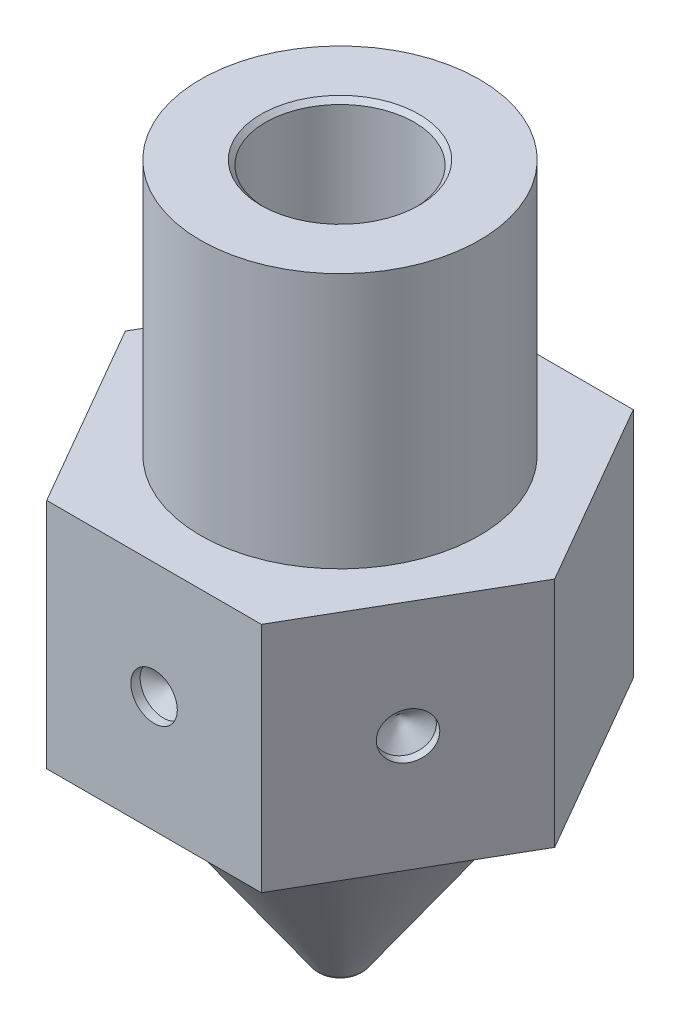
ISO-10303-21;
HEADER;
FILE_DESCRIPTION(('STEP AP214'),'2;1');
FILE_NAME('part.step','',(''),(''),'','','');
FILE_SCHEMA(('AUTOMOTIVE_DESIGN { 1 0 10303 214 1 1 1 1 }'));
ENDSEC;
DATA;
#1=APPLICATION_CONTEXT('core data for automotive mechanical design processes');
#2=APPLICATION_PROTOCOL_DEFINITION('international standard','automotive_design',2000,#1);
#3=PRODUCT_CONTEXT('',#1,'mechanical');
#4=PRODUCT('Part','Part','',(#3));
#5=PRODUCT_RELATED_PRODUCT_CATEGORY('part','',(#4));
#6=PRODUCT_DEFINITION_FORMATION('','',#4);
#7=PRODUCT_DEFINITION_CONTEXT('part definition',#1,'design');
#8=PRODUCT_DEFINITION('design','',#6,#7);
#9=PRODUCT_DEFINITION_SHAPE('','',#8);
#10=(LENGTH_UNIT() NAMED_UNIT(*) SI_UNIT(.MILLI.,.METRE.));
#11=(NAMED_UNIT(*) PLANE_ANGLE_UNIT() SI_UNIT($,.RADIAN.));
#12=(NAMED_UNIT(*) SI_UNIT($,.STERADIAN.) SOLID_ANGLE_UNIT());
#13=UNCERTAINTY_MEASURE_WITH_UNIT(LENGTH_MEASURE(1.E-05),#10,'distance_accuracy_value','');
#14=(GEOMETRIC_REPRESENTATION_CONTEXT(3) GLOBAL_UNCERTAINTY_ASSIGNED_CONTEXT((#13)) GLOBAL_UNIT_ASSIGNED_CONTEXT((#10,
#11,#12)) REPRESENTATION_CONTEXT('',''));
#15=CARTESIAN_POINT('',(0.,0.,0.));
#16=DIRECTION('',(0.,0.,1.));
#17=DIRECTION('',(1.,0.,0.));
#18=AXIS2_PLACEMENT_3D('',#15,#16,#17);
#19=CARTESIAN_POINT('',(3.55710403710923,4.5,0.));
#20=DIRECTION('',(0.,-1.,0.));
#21=DIRECTION('',(0.,0.,-1.));
#22=AXIS2_PLACEMENT_3D('',#19,#20,#21);
#23=PLANE('',#22);
#24=CARTESIAN_POINT('',(0.,4.5,0.));
#25=DIRECTION('',(0.,-1.,0.));
#26=DIRECTION('',(0.,0.,-1.));
#27=AXIS2_PLACEMENT_3D('',#24,#25,#26);
#28=CIRCLE('',#27,3.55710403710923);
#29=CARTESIAN_POINT('',(0.,4.5,-3.55710403710923));
#30=VERTEX_POINT('',#29);
#31=EDGE_CURVE('E156',#30,#30,#28,.T.);
#32=ORIENTED_EDGE('',*,*,#31,.F.);
#33=EDGE_LOOP('',(#32));
#34=FACE_BOUND('',#33,.T.);
#35=DIRECTION('',(1.,0.,0.));
#36=VECTOR('',#35,1.);
#37=CARTESIAN_POINT('',(3.55710403710923,4.5,-4.));
#38=LINE('',#37,#36);
#39=CARTESIAN_POINT('',(-2.3094010767585,4.5,-4.));
#40=VERTEX_POINT('',#39);
#41=CARTESIAN_POINT('',(2.3094010767585,4.5,-4.));
#42=VERTEX_POINT('',#41);
#43=EDGE_CURVE('E115',#40,#42,#38,.T.);
#44=ORIENTED_EDGE('',*,*,#43,.T.);
#45=DIRECTION('',(0.5,0.,0.866025403784438));
#46=VECTOR('',#45,1.);
#47=CARTESIAN_POINT('',(4.35337762441506,4.5,-0.459728769979613));
#48=LINE('',#47,#46);
#49=CARTESIAN_POINT('',(4.61880215351701,4.5,0.));
#50=VERTEX_POINT('',#49);
#51=EDGE_CURVE('E141',#42,#50,#48,.T.);
#52=ORIENTED_EDGE('',*,*,#51,.T.);
#53=DIRECTION('',(-0.5,0.,0.866025403784439));
#54=VECTOR('',#53,1.);
#55=CARTESIAN_POINT('',(4.35337762441506,4.5,0.459728769979613));
#56=LINE('',#55,#54);
#57=CARTESIAN_POINT('',(2.30940107675851,4.5,4.));
#58=VERTEX_POINT('',#57);
#59=EDGE_CURVE('E138',#50,#58,#56,.T.);
#60=ORIENTED_EDGE('',*,*,#59,.T.);
#61=DIRECTION('',(-1.,0.,0.));
#62=VECTOR('',#61,1.);
#63=CARTESIAN_POINT('',(3.55710403710923,4.5,4.));
#64=LINE('',#63,#62);
#65=CARTESIAN_POINT('',(-2.3094010767585,4.5,4.));
#66=VERTEX_POINT('',#65);
#67=EDGE_CURVE('E135',#58,#66,#64,.T.);
#68=ORIENTED_EDGE('',*,*,#67,.T.);
#69=DIRECTION('',(-0.500000000000001,0.,-0.866025403784438));
#70=VECTOR('',#69,1.);
#71=CARTESIAN_POINT('',(-2.57482560586044,4.5,3.54027123002039));
#72=LINE('',#71,#70);
#73=CARTESIAN_POINT('',(-4.61880215351701,4.5,0.));
#74=VERTEX_POINT('',#73);
#75=EDGE_CURVE('E132',#66,#74,#72,.T.);
#76=ORIENTED_EDGE('',*,*,#75,.T.);
#77=DIRECTION('',(0.5,0.,-0.866025403784439));
#78=VECTOR('',#77,1.);
#79=CARTESIAN_POINT('',(-2.57482560586045,4.5,-3.54027123002039));
#80=LINE('',#79,#78);
#81=EDGE_CURVE('E129',#74,#40,#80,.T.);
#82=ORIENTED_EDGE('',*,*,#81,.T.);
#83=EDGE_LOOP('',(#44,#52,#60,#68,#76,#82));
#84=FACE_BOUND('',#83,.T.);
#85=ADVANCED_FACE('F35',(#34,#84),#23,.T.);
#86=CARTESIAN_POINT('',(7.05814172815778,9.5,0.));
#87=DIRECTION('',(0.,1.,0.));
#88=DIRECTION('',(0.,0.,1.));
#89=AXIS2_PLACEMENT_3D('',#86,#87,#88);
#90=PLANE('',#89);
#91=CARTESIAN_POINT('',(0.,9.5,0.));
#92=DIRECTION('',(0.,-1.,0.));
#93=DIRECTION('',(0.,0.,-1.));
#94=AXIS2_PLACEMENT_3D('',#91,#92,#93);
#95=CIRCLE('',#94,3.);
#96=CARTESIAN_POINT('',(0.,9.5,-3.));
#97=VERTEX_POINT('',#96);
#98=EDGE_CURVE('E153',#97,#97,#95,.T.);
#99=ORIENTED_EDGE('',*,*,#98,.T.);
#100=EDGE_LOOP('',(#99));
#101=FACE_BOUND('',#100,.T.);
#102=DIRECTION('',(0.5,0.,-0.866025403784439));
#103=VECTOR('',#102,1.);
#104=CARTESIAN_POINT('',(5.2286370471772,9.5,-1.05626502004782));
#105=LINE('',#104,#103);
#106=CARTESIAN_POINT('',(2.30940107675851,9.5,4.));
#107=VERTEX_POINT('',#106);
#108=CARTESIAN_POINT('',(4.61880215351701,9.5,0.));
#109=VERTEX_POINT('',#108);
#110=EDGE_CURVE('E180',#107,#109,#105,.T.);
#111=ORIENTED_EDGE('',*,*,#110,.T.);
#112=DIRECTION('',(-0.5,0.,-0.866025403784438));
#113=VECTOR('',#112,1.);
#114=CARTESIAN_POINT('',(5.2286370471772,9.5,1.05626502004782));
#115=LINE('',#114,#113);
#116=CARTESIAN_POINT('',(2.3094010767585,9.5,-4.));
#117=VERTEX_POINT('',#116);
#118=EDGE_CURVE('E183',#109,#117,#115,.T.);
#119=ORIENTED_EDGE('',*,*,#118,.T.);
#120=DIRECTION('',(-1.,0.,0.));
#121=VECTOR('',#120,1.);
#122=CARTESIAN_POINT('',(7.05814172815778,9.5,-4.));
#123=LINE('',#122,#121);
#124=CARTESIAN_POINT('',(-2.3094010767585,9.5,-4.));
#125=VERTEX_POINT('',#124);
#126=EDGE_CURVE('E168',#117,#125,#123,.T.);
#127=ORIENTED_EDGE('',*,*,#126,.T.);
#128=DIRECTION('',(-0.5,0.,0.866025403784439));
#129=VECTOR('',#128,1.);
#130=CARTESIAN_POINT('',(-1.69956618309831,9.5,-5.05626502004782));
#131=LINE('',#130,#129);
#132=CARTESIAN_POINT('',(-4.61880215351701,9.5,0.));
#133=VERTEX_POINT('',#132);
#134=EDGE_CURVE('E171',#125,#133,#131,.T.);
#135=ORIENTED_EDGE('',*,*,#134,.T.);
#136=DIRECTION('',(0.500000000000001,0.,0.866025403784438));
#137=VECTOR('',#136,1.);
#138=CARTESIAN_POINT('',(-1.6995661830983,9.5,5.05626502004782));
#139=LINE('',#138,#137);
#140=CARTESIAN_POINT('',(-2.3094010767585,9.5,4.));
#141=VERTEX_POINT('',#140);
#142=EDGE_CURVE('E174',#133,#141,#139,.T.);
#143=ORIENTED_EDGE('',*,*,#142,.T.);
#144=DIRECTION('',(1.,0.,0.));
#145=VECTOR('',#144,1.);
#146=CARTESIAN_POINT('',(7.05814172815779,9.5,4.));
#147=LINE('',#146,#145);
#148=EDGE_CURVE('E177',#141,#107,#147,.T.);
#149=ORIENTED_EDGE('',*,*,#148,.T.);
#150=EDGE_LOOP('',(#111,#119,#127,#135,#143,#149));
#151=FACE_BOUND('',#150,.T.);
#152=ADVANCED_FACE('F205',(#101,#151),#90,.T.);
#153=CARTESIAN_POINT('',(0.,0.,0.));
#154=DIRECTION('',(0.,-1.,0.));
#155=DIRECTION('',(0.,0.,-1.));
#156=AXIS2_PLACEMENT_3D('',#153,#154,#155);
#157=CYLINDRICAL_SURFACE('',#156,0.2);
#158=CARTESIAN_POINT('',(0.,0.,0.));
#159=DIRECTION('',(0.,-1.,0.));
#160=DIRECTION('',(0.,0.,-1.));
#161=AXIS2_PLACEMENT_3D('',#158,#159,#160);
#162=CIRCLE('',#161,0.2);
#163=CARTESIAN_POINT('',(0.,0.,-0.2));
#164=VERTEX_POINT('',#163);
#165=EDGE_CURVE('E165',#164,#164,#162,.T.);
#166=ORIENTED_EDGE('',*,*,#165,.T.);
#167=EDGE_LOOP('',(#166));
#168=FACE_BOUND('',#167,.T.);
#169=CARTESIAN_POINT('',(0.,0.8,0.));
#170=DIRECTION('',(0.,-1.,0.));
#171=DIRECTION('',(0.,0.,-1.));
#172=AXIS2_PLACEMENT_3D('',#169,#170,#171);
#173=CIRCLE('',#172,0.2);
#174=CARTESIAN_POINT('',(0.,0.8,-0.2));
#175=VERTEX_POINT('',#174);
#176=EDGE_CURVE('E144',#175,#175,#173,.T.);
#177=ORIENTED_EDGE('',*,*,#176,.F.);
#178=EDGE_LOOP('',(#177));
#179=FACE_BOUND('',#178,.T.);
#180=ADVANCED_FACE('F211',(#168,#179),#157,.F.);
#181=CARTESIAN_POINT('',(0.2,0.,0.));
#182=DIRECTION('',(0.,-1.,0.));
#183=DIRECTION('',(0.,0.,-1.));
#184=AXIS2_PLACEMENT_3D('',#181,#182,#183);
#185=PLANE('',#184);
#186=CARTESIAN_POINT('',(0.,0.,0.));
#187=DIRECTION('',(0.,-1.,0.));
#188=DIRECTION('',(0.,0.,-1.));
#189=AXIS2_PLACEMENT_3D('',#186,#187,#188);
#190=CIRCLE('',#189,0.25);
#191=CARTESIAN_POINT('',(0.,0.,-0.25));
#192=VERTEX_POINT('',#191);
#193=EDGE_CURVE('E162',#192,#192,#190,.T.);
#194=ORIENTED_EDGE('',*,*,#193,.T.);
#195=EDGE_LOOP('',(#194));
#196=FACE_BOUND('',#195,.T.);
#197=ORIENTED_EDGE('',*,*,#165,.F.);
#198=EDGE_LOOP('',(#197));
#199=FACE_BOUND('',#198,.T.);
#200=ADVANCED_FACE('F226',(#196,#199),#185,.T.);
#201=CARTESIAN_POINT('',(0.,0.3,0.));
#202=DIRECTION('',(0.,-1.,0.));
#203=DIRECTION('',(0.,0.,-1.));
#204=AXIS2_PLACEMENT_3D('',#201,#202,#203);
#205=DEGENERATE_TOROIDAL_SURFACE('',#204,0.25,0.3,.T.);
#206=CARTESIAN_POINT('',(0.,0.127927069094686,0.));
#207=DIRECTION('',(0.,-1.,0.));
#208=DIRECTION('',(0.,0.,-1.));
#209=AXIS2_PLACEMENT_3D('',#206,#207,#208);
#210=CIRCLE('',#209,0.495745613286697);
#211=CARTESIAN_POINT('',(0.,0.127927069094686,-0.495745613286697));
#212=VERTEX_POINT('',#211);
#213=EDGE_CURVE('E159',#212,#212,#210,.T.);
#214=ORIENTED_EDGE('',*,*,#213,.T.);
#215=EDGE_LOOP('',(#214));
#216=FACE_BOUND('',#215,.T.);
#217=ORIENTED_EDGE('',*,*,#193,.F.);
#218=EDGE_LOOP('',(#217));
#219=FACE_BOUND('',#218,.T.);
#220=ADVANCED_FACE('F222',(#216,#219),#205,.T.);
#221=CARTESIAN_POINT('',(0.,0.127927069094686,0.));
#222=DIRECTION('',(0.,1.,0.));
#223=DIRECTION('',(0.,0.,1.));
#224=AXIS2_PLACEMENT_3D('',#221,#222,#223);
#225=CONICAL_SURFACE('',#224,0.495745613286697,0.610865238198017);
#226=ORIENTED_EDGE('',*,*,#31,.T.);
#227=EDGE_LOOP('',(#226));
#228=FACE_BOUND('',#227,.T.);
#229=ORIENTED_EDGE('',*,*,#213,.F.);
#230=EDGE_LOOP('',(#229));
#231=FACE_BOUND('',#230,.T.);
#232=ADVANCED_FACE('F218',(#228,#231),#225,.T.);
#233=CARTESIAN_POINT('',(0.,0.,0.));
#234=DIRECTION('',(0.,-1.,0.));
#235=DIRECTION('',(0.,0.,-1.));
#236=AXIS2_PLACEMENT_3D('',#233,#234,#235);
#237=CYLINDRICAL_SURFACE('',#236,3.);
#238=CARTESIAN_POINT('',(0.,15.,0.));
#239=DIRECTION('',(0.,-1.,0.));
#240=DIRECTION('',(0.,0.,-1.));
#241=AXIS2_PLACEMENT_3D('',#238,#239,#240);
#242=CIRCLE('',#241,3.);
#243=CARTESIAN_POINT('',(0.,15.,-3.));
#244=VERTEX_POINT('',#243);
#245=EDGE_CURVE('E150',#244,#244,#242,.T.);
#246=ORIENTED_EDGE('',*,*,#245,.T.);
#247=EDGE_LOOP('',(#246));
#248=FACE_BOUND('',#247,.T.);
#249=ORIENTED_EDGE('',*,*,#98,.F.);
#250=EDGE_LOOP('',(#249));
#251=FACE_BOUND('',#250,.T.);
#252=ADVANCED_FACE('F221',(#248,#251),#237,.T.);
#253=CARTESIAN_POINT('',(3.,15.,0.));
#254=DIRECTION('',(0.,1.,0.));
#255=DIRECTION('',(0.,0.,1.));
#256=AXIS2_PLACEMENT_3D('',#253,#254,#255);
#257=PLANE('',#256);
#258=CARTESIAN_POINT('',(0.,15.,0.));
#259=DIRECTION('',(0.,1.,0.));
#260=DIRECTION('',(0.,0.,1.));
#261=AXIS2_PLACEMENT_3D('',#258,#259,#260);
#262=CIRCLE('',#261,1.7);
#263=CARTESIAN_POINT('',(0.,15.,1.7));
#264=VERTEX_POINT('',#263);
#265=EDGE_CURVE('E43',#264,#264,#262,.F.);
#266=ORIENTED_EDGE('',*,*,#265,.T.);
#267=EDGE_LOOP('',(#266));
#268=FACE_BOUND('',#267,.T.);
#269=ORIENTED_EDGE('',*,*,#245,.F.);
#270=EDGE_LOOP('',(#269));
#271=FACE_BOUND('',#270,.T.);
#272=ADVANCED_FACE('F188',(#268,#271),#257,.T.);
#273=CARTESIAN_POINT('',(0.,0.,0.));
#274=DIRECTION('',(0.,-1.,0.));
#275=DIRECTION('',(0.,0.,-1.));
#276=AXIS2_PLACEMENT_3D('',#273,#274,#275);
#277=CYLINDRICAL_SURFACE('',#276,1.6);
#278=CARTESIAN_POINT('',(0.,14.9,0.));
#279=DIRECTION('',(0.,1.,0.));
#280=DIRECTION('',(0.,0.,1.));
#281=AXIS2_PLACEMENT_3D('',#278,#279,#280);
#282=CIRCLE('',#281,1.6);
#283=CARTESIAN_POINT('',(0.,14.9,1.6));
#284=VERTEX_POINT('',#283);
#285=EDGE_CURVE('E12',#284,#284,#282,.T.);
#286=ORIENTED_EDGE('',*,*,#285,.T.);
#287=EDGE_LOOP('',(#286));
#288=FACE_BOUND('',#287,.T.);
#289=CARTESIAN_POINT('',(0.,2.79940720943896,0.));
#290=DIRECTION('',(0.,-1.,0.));
#291=DIRECTION('',(0.,0.,-1.));
#292=AXIS2_PLACEMENT_3D('',#289,#290,#291);
#293=CIRCLE('',#292,1.6);
#294=CARTESIAN_POINT('',(0.,2.79940720943896,-1.6));
#295=VERTEX_POINT('',#294);
#296=EDGE_CURVE('E147',#295,#295,#293,.T.);
#297=ORIENTED_EDGE('',*,*,#296,.T.);
#298=EDGE_LOOP('',(#297));
#299=FACE_BOUND('',#298,.T.);
#300=ADVANCED_FACE('F242',(#288,#299),#277,.F.);
#301=CARTESIAN_POINT('',(0.,2.79940720943896,0.));
#302=DIRECTION('',(0.,1.,0.));
#303=DIRECTION('',(0.,0.,1.));
#304=AXIS2_PLACEMENT_3D('',#301,#302,#303);
#305=CONICAL_SURFACE('',#304,1.6,0.610865238198017);
#306=ORIENTED_EDGE('',*,*,#176,.T.);
#307=EDGE_LOOP('',(#306));
#308=FACE_BOUND('',#307,.T.);
#309=ORIENTED_EDGE('',*,*,#296,.F.);
#310=EDGE_LOOP('',(#309));
#311=FACE_BOUND('',#310,.T.);
#312=ADVANCED_FACE('F238',(#308,#311),#305,.F.);
#313=CARTESIAN_POINT('',(4.61880215351701,3.5,0.));
#314=DIRECTION('',(0.866025403784438,0.,-0.5));
#315=DIRECTION('',(-0.5,0.,-0.866025403784438));
#316=AXIS2_PLACEMENT_3D('',#313,#314,#315);
#317=PLANE('',#316);
#318=DIRECTION('',(0.,1.,0.));
#319=VECTOR('',#318,1.);
#320=CARTESIAN_POINT('',(2.3094010767585,3.5,-4.));
#321=LINE('',#320,#319);
#322=EDGE_CURVE('E50',#42,#117,#321,.T.);
#323=ORIENTED_EDGE('',*,*,#322,.T.);
#324=ORIENTED_EDGE('',*,*,#118,.F.);
#325=DIRECTION('',(0.,1.,0.));
#326=VECTOR('',#325,1.);
#327=CARTESIAN_POINT('',(4.61880215351701,3.5,0.));
#328=LINE('',#327,#326);
#329=EDGE_CURVE('E112',#50,#109,#328,.T.);
#330=ORIENTED_EDGE('',*,*,#329,.F.);
#331=ORIENTED_EDGE('',*,*,#51,.F.);
#332=EDGE_LOOP('',(#323,#324,#330,#331));
#333=FACE_BOUND('',#332,.T.);
#334=ADVANCED_FACE('F241',(#333),#317,.T.);
#335=CARTESIAN_POINT('',(2.30940107675851,3.5,4.));
#336=DIRECTION('',(0.866025403784439,0.,0.5));
#337=DIRECTION('',(0.5,0.,-0.866025403784439));
#338=AXIS2_PLACEMENT_3D('',#335,#336,#337);
#339=PLANE('',#338);
#340=CARTESIAN_POINT('',(3.46410161513776,7.,2.));
#341=DIRECTION('',(0.866025403784439,0.,0.5));
#342=DIRECTION('',(0.5,0.,-0.866025403784439));
#343=AXIS2_PLACEMENT_3D('',#340,#341,#342);
#344=CIRCLE('',#343,0.5);
#345=CARTESIAN_POINT('',(3.71410161513776,7.,1.56698729810778));
#346=VERTEX_POINT('',#345);
#347=EDGE_CURVE('E102',#346,#346,#344,.T.);
#348=ORIENTED_EDGE('',*,*,#347,.F.);
#349=EDGE_LOOP('',(#348));
#350=FACE_BOUND('',#349,.T.);
#351=ORIENTED_EDGE('',*,*,#329,.T.);
#352=ORIENTED_EDGE('',*,*,#110,.F.);
#353=DIRECTION('',(0.,1.,0.));
#354=VECTOR('',#353,1.);
#355=CARTESIAN_POINT('',(2.30940107675851,3.5,4.));
#356=LINE('',#355,#354);
#357=EDGE_CURVE('E116',#58,#107,#356,.T.);
#358=ORIENTED_EDGE('',*,*,#357,.F.);
#359=ORIENTED_EDGE('',*,*,#59,.F.);
#360=EDGE_LOOP('',(#351,#352,#358,#359));
#361=FACE_BOUND('',#360,.T.);
#362=ADVANCED_FACE('F264',(#350,#361),#339,.T.);
#363=CARTESIAN_POINT('',(-2.3094010767585,3.5,4.));
#364=DIRECTION('',(0.,0.,1.));
#365=DIRECTION('',(1.,0.,0.));
#366=AXIS2_PLACEMENT_3D('',#363,#364,#365);
#367=PLANE('',#366);
#368=CARTESIAN_POINT('',(0.,7.,4.));
#369=DIRECTION('',(0.,0.,1.));
#370=DIRECTION('',(1.,0.,0.));
#371=AXIS2_PLACEMENT_3D('',#368,#369,#370);
#372=CIRCLE('',#371,0.499999999999999);
#373=CARTESIAN_POINT('',(0.500000000000003,7.,4.));
#374=VERTEX_POINT('',#373);
#375=EDGE_CURVE('E101',#374,#374,#372,.T.);
#376=ORIENTED_EDGE('',*,*,#375,.F.);
#377=EDGE_LOOP('',(#376));
#378=FACE_BOUND('',#377,.T.);
#379=ORIENTED_EDGE('',*,*,#357,.T.);
#380=ORIENTED_EDGE('',*,*,#148,.F.);
#381=DIRECTION('',(0.,1.,0.));
#382=VECTOR('',#381,1.);
#383=CARTESIAN_POINT('',(-2.3094010767585,3.5,4.));
#384=LINE('',#383,#382);
#385=EDGE_CURVE('E119',#66,#141,#384,.T.);
#386=ORIENTED_EDGE('',*,*,#385,.F.);
#387=ORIENTED_EDGE('',*,*,#67,.F.);
#388=EDGE_LOOP('',(#379,#380,#386,#387));
#389=FACE_BOUND('',#388,.T.);
#390=ADVANCED_FACE('F267',(#378,#389),#367,.T.);
#391=CARTESIAN_POINT('',(-4.61880215351701,3.5,0.));
#392=DIRECTION('',(-0.866025403784438,0.,0.500000000000001));
#393=DIRECTION('',(0.500000000000001,0.,0.866025403784438));
#394=AXIS2_PLACEMENT_3D('',#391,#392,#393);
#395=PLANE('',#394);
#396=ORIENTED_EDGE('',*,*,#385,.T.);
#397=ORIENTED_EDGE('',*,*,#142,.F.);
#398=DIRECTION('',(0.,1.,0.));
#399=VECTOR('',#398,1.);
#400=CARTESIAN_POINT('',(-4.61880215351701,3.5,0.));
#401=LINE('',#400,#399);
#402=EDGE_CURVE('E122',#74,#133,#401,.T.);
#403=ORIENTED_EDGE('',*,*,#402,.F.);
#404=ORIENTED_EDGE('',*,*,#75,.F.);
#405=EDGE_LOOP('',(#396,#397,#403,#404));
#406=FACE_BOUND('',#405,.T.);
#407=ADVANCED_FACE('F273',(#406),#395,.T.);
#408=CARTESIAN_POINT('',(-2.3094010767585,3.5,-4.));
#409=DIRECTION('',(-0.866025403784438,0.,-0.5));
#410=DIRECTION('',(-0.5,0.,0.866025403784439));
#411=AXIS2_PLACEMENT_3D('',#408,#409,#410);
#412=PLANE('',#411);
#413=ORIENTED_EDGE('',*,*,#402,.T.);
#414=ORIENTED_EDGE('',*,*,#134,.F.);
#415=DIRECTION('',(0.,1.,0.));
#416=VECTOR('',#415,1.);
#417=CARTESIAN_POINT('',(-2.3094010767585,3.5,-4.));
#418=LINE('',#417,#416);
#419=EDGE_CURVE('E55',#40,#125,#418,.T.);
#420=ORIENTED_EDGE('',*,*,#419,.F.);
#421=ORIENTED_EDGE('',*,*,#81,.F.);
#422=EDGE_LOOP('',(#413,#414,#420,#421));
#423=FACE_BOUND('',#422,.T.);
#424=ADVANCED_FACE('F201',(#423),#412,.T.);
#425=CARTESIAN_POINT('',(2.3094010767585,3.5,-4.));
#426=DIRECTION('',(0.,0.,-1.));
#427=DIRECTION('',(-1.,0.,0.));
#428=AXIS2_PLACEMENT_3D('',#425,#426,#427);
#429=PLANE('',#428);
#430=ORIENTED_EDGE('',*,*,#419,.T.);
#431=ORIENTED_EDGE('',*,*,#126,.F.);
#432=ORIENTED_EDGE('',*,*,#322,.F.);
#433=ORIENTED_EDGE('',*,*,#43,.F.);
#434=EDGE_LOOP('',(#430,#431,#432,#433));
#435=FACE_BOUND('',#434,.T.);
#436=ADVANCED_FACE('F193',(#435),#429,.T.);
#437=CARTESIAN_POINT('',(0.,15.,0.));
#438=DIRECTION('',(0.,1.,0.));
#439=DIRECTION('',(0.,0.,1.));
#440=AXIS2_PLACEMENT_3D('',#437,#438,#439);
#441=CONICAL_SURFACE('',#440,1.7,0.785398163397439);
#442=ORIENTED_EDGE('',*,*,#285,.F.);
#443=EDGE_LOOP('',(#442));
#444=FACE_BOUND('',#443,.T.);
#445=ORIENTED_EDGE('',*,*,#265,.F.);
#446=EDGE_LOOP('',(#445));
#447=FACE_BOUND('',#446,.T.);
#448=ADVANCED_FACE('F37',(#444,#447),#441,.F.);
#449=CARTESIAN_POINT('',(0.,7.,3.8));
#450=DIRECTION('',(0.,0.,1.));
#451=DIRECTION('',(1.,0.,0.));
#452=AXIS2_PLACEMENT_3D('',#449,#450,#451);
#453=CONICAL_SURFACE('',#452,0.499999999999999,1.02974425867665);
#454=CARTESIAN_POINT('',(0.,7.,3.49956969048622));
#455=VERTEX_POINT('',#454);
#456=VERTEX_LOOP('',#455);
#457=FACE_BOUND('',#456,.T.);
#458=CARTESIAN_POINT('',(0.,7.,3.8));
#459=DIRECTION('',(0.,0.,1.));
#460=DIRECTION('',(1.,0.,0.));
#461=AXIS2_PLACEMENT_3D('',#458,#459,#460);
#462=CIRCLE('',#461,0.499999999999999);
#463=CARTESIAN_POINT('',(0.500000000000003,7.,3.8));
#464=VERTEX_POINT('',#463);
#465=EDGE_CURVE('E105',#464,#464,#462,.T.);
#466=ORIENTED_EDGE('',*,*,#465,.T.);
#467=EDGE_LOOP('',(#466));
#468=FACE_BOUND('',#467,.T.);
#469=ADVANCED_FACE('F192',(#457,#468),#453,.F.);
#470=CARTESIAN_POINT('',(0.,7.,4.));
#471=DIRECTION('',(0.,0.,1.));
#472=DIRECTION('',(1.,0.,0.));
#473=AXIS2_PLACEMENT_3D('',#470,#471,#472);
#474=CYLINDRICAL_SURFACE('',#473,0.499999999999999);
#475=ORIENTED_EDGE('',*,*,#465,.F.);
#476=EDGE_LOOP('',(#475));
#477=FACE_BOUND('',#476,.T.);
#478=ORIENTED_EDGE('',*,*,#375,.T.);
#479=EDGE_LOOP('',(#478));
#480=FACE_BOUND('',#479,.T.);
#481=ADVANCED_FACE('F95',(#477,#480),#474,.F.);
#482=CARTESIAN_POINT('',(3.29089653438087,7.,1.9));
#483=DIRECTION('',(0.866025403784439,0.,0.5));
#484=DIRECTION('',(0.5,0.,-0.866025403784439));
#485=AXIS2_PLACEMENT_3D('',#482,#483,#484);
#486=CONICAL_SURFACE('',#485,0.5,1.02974425867665);
#487=CARTESIAN_POINT('',(3.03071625427511,7.,1.74978484524311));
#488=VERTEX_POINT('',#487);
#489=VERTEX_LOOP('',#488);
#490=FACE_BOUND('',#489,.T.);
#491=CARTESIAN_POINT('',(3.29089653438087,7.,1.9));
#492=DIRECTION('',(0.866025403784439,0.,0.5));
#493=DIRECTION('',(0.5,0.,-0.866025403784439));
#494=AXIS2_PLACEMENT_3D('',#491,#492,#493);
#495=CIRCLE('',#494,0.5);
#496=CARTESIAN_POINT('',(3.54089653438087,7.,1.46698729810778));
#497=VERTEX_POINT('',#496);
#498=EDGE_CURVE('E99',#497,#497,#495,.T.);
#499=ORIENTED_EDGE('',*,*,#498,.T.);
#500=EDGE_LOOP('',(#499));
#501=FACE_BOUND('',#500,.T.);
#502=ADVANCED_FACE('F91',(#490,#501),#486,.F.);
#503=CARTESIAN_POINT('',(3.46410161513776,7.,2.));
#504=DIRECTION('',(0.866025403784439,0.,0.5));
#505=DIRECTION('',(0.5,0.,-0.866025403784439));
#506=AXIS2_PLACEMENT_3D('',#503,#504,#505);
#507=CYLINDRICAL_SURFACE('',#506,0.5);
#508=ORIENTED_EDGE('',*,*,#498,.F.);
#509=EDGE_LOOP('',(#508));
#510=FACE_BOUND('',#509,.T.);
#511=ORIENTED_EDGE('',*,*,#347,.T.);
#512=EDGE_LOOP('',(#511));
#513=FACE_BOUND('',#512,.T.);
#514=ADVANCED_FACE('F94',(#510,#513),#507,.F.);
#515=CLOSED_SHELL('',(#85,#152,#180,#200,#220,#232,#252,#272,#300,#312,#334,#362,#390,#407,#424,
#436,#448,#469,#481,#502,#514));
#516=MANIFOLD_SOLID_BREP('B2',#515);
#517=ADVANCED_BREP_SHAPE_REPRESENTATION('',(#18,#516),#14);
#518=SHAPE_DEFINITION_REPRESENTATION(#9,#517);
ENDSEC;
END-ISO-10303-21;
